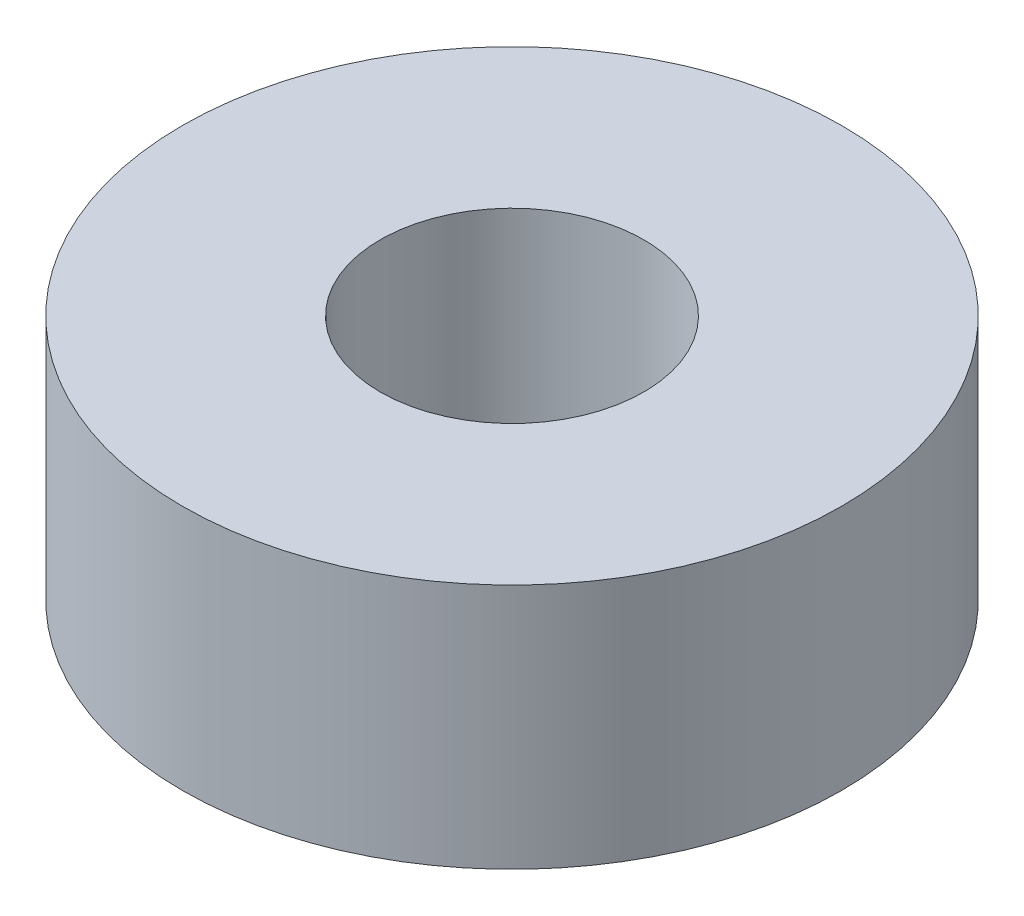
ISO-10303-21;
HEADER;
FILE_DESCRIPTION(('STEP AP214'),'2;1');
FILE_NAME('part.step','',(''),(''),'','','');
FILE_SCHEMA(('AUTOMOTIVE_DESIGN { 1 0 10303 214 1 1 1 1 }'));
ENDSEC;
DATA;
#1=APPLICATION_CONTEXT('core data for automotive mechanical design processes');
#2=APPLICATION_PROTOCOL_DEFINITION('international standard','automotive_design',2000,#1);
#3=PRODUCT_CONTEXT('',#1,'mechanical');
#4=PRODUCT('Part','Part','',(#3));
#5=PRODUCT_RELATED_PRODUCT_CATEGORY('part','',(#4));
#6=PRODUCT_DEFINITION_FORMATION('','',#4);
#7=PRODUCT_DEFINITION_CONTEXT('part definition',#1,'design');
#8=PRODUCT_DEFINITION('design','',#6,#7);
#9=PRODUCT_DEFINITION_SHAPE('','',#8);
#10=(LENGTH_UNIT() NAMED_UNIT(*) SI_UNIT(.MILLI.,.METRE.));
#11=(NAMED_UNIT(*) PLANE_ANGLE_UNIT() SI_UNIT($,.RADIAN.));
#12=(NAMED_UNIT(*) SI_UNIT($,.STERADIAN.) SOLID_ANGLE_UNIT());
#13=UNCERTAINTY_MEASURE_WITH_UNIT(LENGTH_MEASURE(1.E-05),#10,'distance_accuracy_value','');
#14=(GEOMETRIC_REPRESENTATION_CONTEXT(3) GLOBAL_UNCERTAINTY_ASSIGNED_CONTEXT((#13)) GLOBAL_UNIT_ASSIGNED_CONTEXT((#10,
#11,#12)) REPRESENTATION_CONTEXT('',''));
#15=CARTESIAN_POINT('',(0.,0.,0.));
#16=DIRECTION('',(0.,0.,1.));
#17=DIRECTION('',(1.,0.,0.));
#18=AXIS2_PLACEMENT_3D('',#15,#16,#17);
#19=CARTESIAN_POINT('',(0.,28.,0.));
#20=DIRECTION('',(0.,-1.,0.));
#21=DIRECTION('',(0.,0.,-1.));
#22=AXIS2_PLACEMENT_3D('',#19,#20,#21);
#23=CYLINDRICAL_SURFACE('',#22,37.5);
#24=CARTESIAN_POINT('',(0.,28.,0.));
#25=DIRECTION('',(0.,1.,0.));
#26=DIRECTION('',(0.,0.,1.));
#27=AXIS2_PLACEMENT_3D('',#24,#25,#26);
#28=CIRCLE('',#27,37.5);
#29=CARTESIAN_POINT('',(0.,28.,37.5));
#30=VERTEX_POINT('',#29);
#31=EDGE_CURVE('E10',#30,#30,#28,.T.);
#32=ORIENTED_EDGE('',*,*,#31,.F.);
#33=EDGE_LOOP('',(#32));
#34=FACE_BOUND('',#33,.T.);
#35=CARTESIAN_POINT('',(0.,0.,0.));
#36=DIRECTION('',(0.,1.,0.));
#37=DIRECTION('',(0.,0.,1.));
#38=AXIS2_PLACEMENT_3D('',#35,#36,#37);
#39=CIRCLE('',#38,37.5);
#40=CARTESIAN_POINT('',(0.,0.,37.5));
#41=VERTEX_POINT('',#40);
#42=EDGE_CURVE('E37',#41,#41,#39,.T.);
#43=ORIENTED_EDGE('',*,*,#42,.T.);
#44=EDGE_LOOP('',(#43));
#45=FACE_BOUND('',#44,.T.);
#46=ADVANCED_FACE('F40',(#34,#45),#23,.T.);
#47=CARTESIAN_POINT('',(0.,28.,0.));
#48=DIRECTION('',(0.,1.,0.));
#49=DIRECTION('',(0.,0.,1.));
#50=AXIS2_PLACEMENT_3D('',#47,#48,#49);
#51=PLANE('',#50);
#52=CARTESIAN_POINT('',(0.,28.,0.));
#53=DIRECTION('',(0.,1.,0.));
#54=DIRECTION('',(0.,0.,1.));
#55=AXIS2_PLACEMENT_3D('',#52,#53,#54);
#56=CIRCLE('',#55,15.);
#57=CARTESIAN_POINT('',(0.,28.,15.));
#58=VERTEX_POINT('',#57);
#59=EDGE_CURVE('E50',#58,#58,#56,.T.);
#60=ORIENTED_EDGE('',*,*,#59,.F.);
#61=EDGE_LOOP('',(#60));
#62=FACE_BOUND('',#61,.T.);
#63=ORIENTED_EDGE('',*,*,#31,.T.);
#64=EDGE_LOOP('',(#63));
#65=FACE_BOUND('',#64,.T.);
#66=ADVANCED_FACE('F59',(#62,#65),#51,.T.);
#67=CARTESIAN_POINT('',(0.,0.,0.));
#68=DIRECTION('',(0.,1.,0.));
#69=DIRECTION('',(0.,0.,1.));
#70=AXIS2_PLACEMENT_3D('',#67,#68,#69);
#71=PLANE('',#70);
#72=CARTESIAN_POINT('',(0.,0.,0.));
#73=DIRECTION('',(0.,1.,0.));
#74=DIRECTION('',(0.,0.,1.));
#75=AXIS2_PLACEMENT_3D('',#72,#73,#74);
#76=CIRCLE('',#75,15.);
#77=CARTESIAN_POINT('',(0.,0.,15.));
#78=VERTEX_POINT('',#77);
#79=EDGE_CURVE('E47',#78,#78,#76,.T.);
#80=ORIENTED_EDGE('',*,*,#79,.T.);
#81=EDGE_LOOP('',(#80));
#82=FACE_BOUND('',#81,.T.);
#83=ORIENTED_EDGE('',*,*,#42,.F.);
#84=EDGE_LOOP('',(#83));
#85=FACE_BOUND('',#84,.T.);
#86=ADVANCED_FACE('F58',(#82,#85),#71,.F.);
#87=CARTESIAN_POINT('',(0.,28.,0.));
#88=DIRECTION('',(0.,-1.,0.));
#89=DIRECTION('',(0.,0.,-1.));
#90=AXIS2_PLACEMENT_3D('',#87,#88,#89);
#91=CYLINDRICAL_SURFACE('',#90,15.);
#92=ORIENTED_EDGE('',*,*,#59,.T.);
#93=EDGE_LOOP('',(#92));
#94=FACE_BOUND('',#93,.T.);
#95=ORIENTED_EDGE('',*,*,#79,.F.);
#96=EDGE_LOOP('',(#95));
#97=FACE_BOUND('',#96,.T.);
#98=ADVANCED_FACE('F54',(#94,#97),#91,.F.);
#99=CLOSED_SHELL('',(#46,#66,#86,#98));
#100=MANIFOLD_SOLID_BREP('B2',#99);
#101=ADVANCED_BREP_SHAPE_REPRESENTATION('',(#18,#100),#14);
#102=SHAPE_DEFINITION_REPRESENTATION(#9,#101);
ENDSEC;
END-ISO-10303-21;
